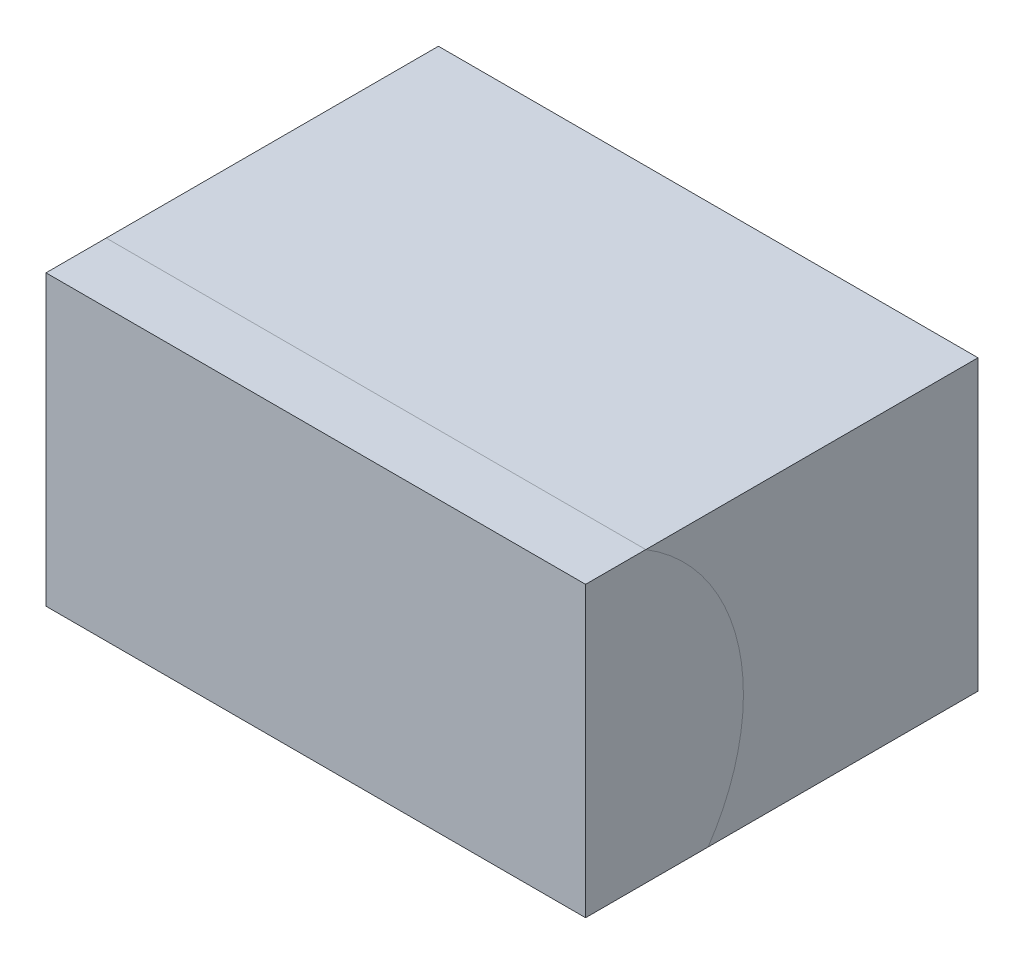
ISO-10303-21;
HEADER;
FILE_DESCRIPTION(('STEP AP214'),'2;1');
FILE_NAME('part.step','',(''),(''),'','','');
FILE_SCHEMA(('AUTOMOTIVE_DESIGN { 1 0 10303 214 1 1 1 1 }'));
ENDSEC;
DATA;
#1=APPLICATION_CONTEXT('core data for automotive mechanical design processes');
#2=APPLICATION_PROTOCOL_DEFINITION('international standard','automotive_design',2000,#1);
#3=PRODUCT_CONTEXT('',#1,'mechanical');
#4=PRODUCT('Part','Part','',(#3));
#5=PRODUCT_RELATED_PRODUCT_CATEGORY('part','',(#4));
#6=PRODUCT_DEFINITION_FORMATION('','',#4);
#7=PRODUCT_DEFINITION_CONTEXT('part definition',#1,'design');
#8=PRODUCT_DEFINITION('design','',#6,#7);
#9=PRODUCT_DEFINITION_SHAPE('','',#8);
#10=(LENGTH_UNIT() NAMED_UNIT(*) SI_UNIT(.MILLI.,.METRE.));
#11=(NAMED_UNIT(*) PLANE_ANGLE_UNIT() SI_UNIT($,.RADIAN.));
#12=(NAMED_UNIT(*) SI_UNIT($,.STERADIAN.) SOLID_ANGLE_UNIT());
#13=UNCERTAINTY_MEASURE_WITH_UNIT(LENGTH_MEASURE(1.E-05),#10,'distance_accuracy_value','');
#14=(GEOMETRIC_REPRESENTATION_CONTEXT(3) GLOBAL_UNCERTAINTY_ASSIGNED_CONTEXT((#13)) GLOBAL_UNIT_ASSIGNED_CONTEXT((#10,
#11,#12)) REPRESENTATION_CONTEXT('',''));
#15=CARTESIAN_POINT('',(0.,0.,0.));
#16=DIRECTION('',(0.,0.,1.));
#17=DIRECTION('',(1.,0.,0.));
#18=AXIS2_PLACEMENT_3D('',#15,#16,#17);
#19=CARTESIAN_POINT('',(-93.4295995241872,-10.287662998454,83.949911321681));
#20=DIRECTION('',(1.,0.,0.));
#21=DIRECTION('',(0.,0.,-1.));
#22=AXIS2_PLACEMENT_3D('',#19,#20,#21);
#23=CYLINDRICAL_SURFACE('',#22,70.6589672597011);
#24=CARTESIAN_POINT('',(93.4295995241872,-10.287662998454,83.949911321681));
#25=DIRECTION('',(-1.,0.,0.));
#26=DIRECTION('',(0.,0.,1.));
#27=AXIS2_PLACEMENT_3D('',#24,#25,#26);
#28=CIRCLE('',#27,70.6589672597011);
#29=CARTESIAN_POINT('',(93.4295995241872,-50.,25.5066059387446));
#30=VERTEX_POINT('',#29);
#31=CARTESIAN_POINT('',(93.4295995241872,50.,47.097674694953));
#32=VERTEX_POINT('',#31);
#33=EDGE_CURVE('E98',#30,#32,#28,.F.);
#34=ORIENTED_EDGE('',*,*,#33,.T.);
#35=DIRECTION('',(1.,0.,0.));
#36=VECTOR('',#35,1.);
#37=CARTESIAN_POINT('',(-93.4295995241872,50.,47.097674694953));
#38=LINE('',#37,#36);
#39=CARTESIAN_POINT('',(-93.4295995241872,50.,47.097674694953));
#40=VERTEX_POINT('',#39);
#41=EDGE_CURVE('E82',#40,#32,#38,.T.);
#42=ORIENTED_EDGE('',*,*,#41,.F.);
#43=CARTESIAN_POINT('',(-93.4295995241872,-10.287662998454,83.949911321681));
#44=DIRECTION('',(1.,0.,0.));
#45=DIRECTION('',(0.,0.,-1.));
#46=AXIS2_PLACEMENT_3D('',#43,#44,#45);
#47=CIRCLE('',#46,70.6589672597011);
#48=CARTESIAN_POINT('',(-93.4295995241872,-50.,25.5066059387446));
#49=VERTEX_POINT('',#48);
#50=EDGE_CURVE('E102',#40,#49,#47,.F.);
#51=ORIENTED_EDGE('',*,*,#50,.T.);
#52=DIRECTION('',(1.,0.,0.));
#53=VECTOR('',#52,1.);
#54=CARTESIAN_POINT('',(-93.4295995241872,-50.,25.5066059387446));
#55=LINE('',#54,#53);
#56=EDGE_CURVE('E95',#49,#30,#55,.T.);
#57=ORIENTED_EDGE('',*,*,#56,.T.);
#58=EDGE_LOOP('',(#34,#42,#51,#57));
#59=FACE_BOUND('',#58,.T.);
#60=ADVANCED_FACE('F50',(#59),#23,.F.);
#61=CARTESIAN_POINT('',(0.,50.,0.));
#62=DIRECTION('',(0.,1.,0.));
#63=DIRECTION('',(0.,0.,1.));
#64=AXIS2_PLACEMENT_3D('',#61,#62,#63);
#65=PLANE('',#64);
#66=DIRECTION('',(0.,0.,1.));
#67=VECTOR('',#66,1.);
#68=CARTESIAN_POINT('',(-93.4295995241872,50.,-67.9487996539543));
#69=LINE('',#68,#67);
#70=CARTESIAN_POINT('',(-93.4295995241872,50.,-67.9487996539543));
#71=VERTEX_POINT('',#70);
#72=EDGE_CURVE('E109',#71,#40,#69,.T.);
#73=ORIENTED_EDGE('',*,*,#72,.T.);
#74=ORIENTED_EDGE('',*,*,#41,.T.);
#75=DIRECTION('',(0.,0.,-1.));
#76=VECTOR('',#75,1.);
#77=CARTESIAN_POINT('',(93.4295995241872,50.,-67.9487996539543));
#78=LINE('',#77,#76);
#79=CARTESIAN_POINT('',(93.4295995241872,50.,-67.9487996539543));
#80=VERTEX_POINT('',#79);
#81=EDGE_CURVE('E100',#32,#80,#78,.T.);
#82=ORIENTED_EDGE('',*,*,#81,.T.);
#83=DIRECTION('',(-1.,0.,0.));
#84=VECTOR('',#83,1.);
#85=CARTESIAN_POINT('',(-93.4295995241872,50.,-67.9487996539543));
#86=LINE('',#85,#84);
#87=EDGE_CURVE('E77',#80,#71,#86,.T.);
#88=ORIENTED_EDGE('',*,*,#87,.T.);
#89=EDGE_LOOP('',(#73,#74,#82,#88));
#90=FACE_BOUND('',#89,.T.);
#91=ADVANCED_FACE('F52',(#90),#65,.T.);
#92=CARTESIAN_POINT('',(0.,-50.,0.));
#93=DIRECTION('',(0.,1.,0.));
#94=DIRECTION('',(0.,0.,1.));
#95=AXIS2_PLACEMENT_3D('',#92,#93,#94);
#96=PLANE('',#95);
#97=ORIENTED_EDGE('',*,*,#56,.F.);
#98=DIRECTION('',(0.,0.,1.));
#99=VECTOR('',#98,1.);
#100=CARTESIAN_POINT('',(-93.4295995241872,-50.,-67.9487996539543));
#101=LINE('',#100,#99);
#102=CARTESIAN_POINT('',(-93.4295995241872,-50.,-67.9487996539543));
#103=VERTEX_POINT('',#102);
#104=EDGE_CURVE('E112',#103,#49,#101,.T.);
#105=ORIENTED_EDGE('',*,*,#104,.F.);
#106=DIRECTION('',(-1.,0.,0.));
#107=VECTOR('',#106,1.);
#108=CARTESIAN_POINT('',(-93.4295995241872,-50.,-67.9487996539543));
#109=LINE('',#108,#107);
#110=CARTESIAN_POINT('',(93.4295995241872,-50.,-67.9487996539543));
#111=VERTEX_POINT('',#110);
#112=EDGE_CURVE('E59',#111,#103,#109,.T.);
#113=ORIENTED_EDGE('',*,*,#112,.F.);
#114=DIRECTION('',(0.,0.,-1.));
#115=VECTOR('',#114,1.);
#116=CARTESIAN_POINT('',(93.4295995241872,-50.,-67.9487996539543));
#117=LINE('',#116,#115);
#118=EDGE_CURVE('E12',#30,#111,#117,.T.);
#119=ORIENTED_EDGE('',*,*,#118,.F.);
#120=EDGE_LOOP('',(#97,#105,#113,#119));
#121=FACE_BOUND('',#120,.T.);
#122=ADVANCED_FACE('F92',(#121),#96,.F.);
#123=CARTESIAN_POINT('',(93.4295995241872,50.,-67.9487996539543));
#124=DIRECTION('',(-1.,0.,0.));
#125=DIRECTION('',(0.,0.,1.));
#126=AXIS2_PLACEMENT_3D('',#123,#124,#125);
#127=PLANE('',#126);
#128=ORIENTED_EDGE('',*,*,#33,.F.);
#129=ORIENTED_EDGE('',*,*,#118,.T.);
#130=DIRECTION('',(0.,-1.,0.));
#131=VECTOR('',#130,1.);
#132=CARTESIAN_POINT('',(93.4295995241872,50.,-67.9487996539543));
#133=LINE('',#132,#131);
#134=EDGE_CURVE('E122',#80,#111,#133,.T.);
#135=ORIENTED_EDGE('',*,*,#134,.F.);
#136=ORIENTED_EDGE('',*,*,#81,.F.);
#137=EDGE_LOOP('',(#128,#129,#135,#136));
#138=FACE_BOUND('',#137,.T.);
#139=ADVANCED_FACE('F99',(#138),#127,.F.);
#140=CARTESIAN_POINT('',(-93.4295995241872,50.,-67.9487996539543));
#141=DIRECTION('',(0.,0.,1.));
#142=DIRECTION('',(1.,0.,0.));
#143=AXIS2_PLACEMENT_3D('',#140,#141,#142);
#144=PLANE('',#143);
#145=ORIENTED_EDGE('',*,*,#112,.T.);
#146=DIRECTION('',(0.,-1.,0.));
#147=VECTOR('',#146,1.);
#148=CARTESIAN_POINT('',(-93.4295995241872,50.,-67.9487996539543));
#149=LINE('',#148,#147);
#150=EDGE_CURVE('E111',#71,#103,#149,.T.);
#151=ORIENTED_EDGE('',*,*,#150,.F.);
#152=ORIENTED_EDGE('',*,*,#87,.F.);
#153=ORIENTED_EDGE('',*,*,#134,.T.);
#154=EDGE_LOOP('',(#145,#151,#152,#153));
#155=FACE_BOUND('',#154,.T.);
#156=ADVANCED_FACE('F127',(#155),#144,.F.);
#157=CARTESIAN_POINT('',(-93.4295995241872,50.,-67.9487996539543));
#158=DIRECTION('',(1.,0.,0.));
#159=DIRECTION('',(0.,0.,-1.));
#160=AXIS2_PLACEMENT_3D('',#157,#158,#159);
#161=PLANE('',#160);
#162=ORIENTED_EDGE('',*,*,#50,.F.);
#163=ORIENTED_EDGE('',*,*,#72,.F.);
#164=ORIENTED_EDGE('',*,*,#150,.T.);
#165=ORIENTED_EDGE('',*,*,#104,.T.);
#166=EDGE_LOOP('',(#162,#163,#164,#165));
#167=FACE_BOUND('',#166,.T.);
#168=ADVANCED_FACE('F126',(#167),#161,.F.);
#169=CLOSED_SHELL('',(#60,#91,#122,#139,#156,#168));
#170=MANIFOLD_SOLID_BREP('B2',#169);
#171=CARTESIAN_POINT('',(-93.4295995241872,-10.287662998454,83.949911321681));
#172=DIRECTION('',(1.,0.,0.));
#173=DIRECTION('',(0.,0.,-1.));
#174=AXIS2_PLACEMENT_3D('',#171,#172,#173);
#175=CYLINDRICAL_SURFACE('',#174,70.6589672597011);
#176=CARTESIAN_POINT('',(93.4295995241872,-10.287662998454,83.949911321681));
#177=DIRECTION('',(-1.,0.,0.));
#178=DIRECTION('',(0.,0.,1.));
#179=AXIS2_PLACEMENT_3D('',#176,#177,#178);
#180=CIRCLE('',#179,70.6589672597011);
#181=CARTESIAN_POINT('',(93.4295995241872,-50.,25.5066059387446));
#182=VERTEX_POINT('',#181);
#183=CARTESIAN_POINT('',(93.4295995241872,50.,47.097674694953));
#184=VERTEX_POINT('',#183);
#185=EDGE_CURVE('E189',#182,#184,#180,.F.);
#186=ORIENTED_EDGE('',*,*,#185,.F.);
#187=DIRECTION('',(1.,0.,0.));
#188=VECTOR('',#187,1.);
#189=CARTESIAN_POINT('',(-93.4295995241872,-50.,25.5066059387446));
#190=LINE('',#189,#188);
#191=CARTESIAN_POINT('',(-93.4295995241872,-50.,25.5066059387446));
#192=VERTEX_POINT('',#191);
#193=EDGE_CURVE('E238',#192,#182,#190,.T.);
#194=ORIENTED_EDGE('',*,*,#193,.F.);
#195=CARTESIAN_POINT('',(-93.4295995241872,-10.287662998454,83.949911321681));
#196=DIRECTION('',(1.,0.,0.));
#197=DIRECTION('',(0.,0.,-1.));
#198=AXIS2_PLACEMENT_3D('',#195,#196,#197);
#199=CIRCLE('',#198,70.6589672597011);
#200=CARTESIAN_POINT('',(-93.4295995241872,50.,47.097674694953));
#201=VERTEX_POINT('',#200);
#202=EDGE_CURVE('E255',#201,#192,#199,.F.);
#203=ORIENTED_EDGE('',*,*,#202,.F.);
#204=DIRECTION('',(1.,0.,0.));
#205=VECTOR('',#204,1.);
#206=CARTESIAN_POINT('',(-93.4295995241872,50.,47.097674694953));
#207=LINE('',#206,#205);
#208=EDGE_CURVE('E48',#201,#184,#207,.T.);
#209=ORIENTED_EDGE('',*,*,#208,.T.);
#210=EDGE_LOOP('',(#186,#194,#203,#209));
#211=FACE_BOUND('',#210,.T.);
#212=ADVANCED_FACE('F186',(#211),#175,.T.);
#213=CARTESIAN_POINT('',(-93.4295995241872,50.,67.9487996539543));
#214=DIRECTION('',(0.,0.,-1.));
#215=DIRECTION('',(-1.,0.,0.));
#216=AXIS2_PLACEMENT_3D('',#213,#214,#215);
#217=PLANE('',#216);
#218=DIRECTION('',(1.,0.,0.));
#219=VECTOR('',#218,1.);
#220=CARTESIAN_POINT('',(-93.4295995241872,-50.,67.9487996539543));
#221=LINE('',#220,#219);
#222=CARTESIAN_POINT('',(-93.4295995241872,-50.,67.9487996539543));
#223=VERTEX_POINT('',#222);
#224=CARTESIAN_POINT('',(93.4295995241872,-50.,67.9487996539543));
#225=VERTEX_POINT('',#224);
#226=EDGE_CURVE('E252',#223,#225,#221,.T.);
#227=ORIENTED_EDGE('',*,*,#226,.T.);
#228=DIRECTION('',(0.,-1.,0.));
#229=VECTOR('',#228,1.);
#230=CARTESIAN_POINT('',(93.4295995241872,50.,67.9487996539543));
#231=LINE('',#230,#229);
#232=CARTESIAN_POINT('',(93.4295995241872,50.,67.9487996539543));
#233=VERTEX_POINT('',#232);
#234=EDGE_CURVE('E239',#233,#225,#231,.T.);
#235=ORIENTED_EDGE('',*,*,#234,.F.);
#236=DIRECTION('',(1.,0.,0.));
#237=VECTOR('',#236,1.);
#238=CARTESIAN_POINT('',(-93.4295995241872,50.,67.9487996539543));
#239=LINE('',#238,#237);
#240=CARTESIAN_POINT('',(-93.4295995241872,50.,67.9487996539543));
#241=VERTEX_POINT('',#240);
#242=EDGE_CURVE('E226',#241,#233,#239,.T.);
#243=ORIENTED_EDGE('',*,*,#242,.F.);
#244=DIRECTION('',(0.,-1.,0.));
#245=VECTOR('',#244,1.);
#246=CARTESIAN_POINT('',(-93.4295995241872,50.,67.9487996539543));
#247=LINE('',#246,#245);
#248=EDGE_CURVE('E232',#241,#223,#247,.T.);
#249=ORIENTED_EDGE('',*,*,#248,.T.);
#250=EDGE_LOOP('',(#227,#235,#243,#249));
#251=FACE_BOUND('',#250,.T.);
#252=ADVANCED_FACE('F241',(#251),#217,.F.);
#253=CARTESIAN_POINT('',(93.4295995241872,50.,-67.9487996539543));
#254=DIRECTION('',(-1.,0.,0.));
#255=DIRECTION('',(0.,0.,1.));
#256=AXIS2_PLACEMENT_3D('',#253,#254,#255);
#257=PLANE('',#256);
#258=DIRECTION('',(0.,0.,-1.));
#259=VECTOR('',#258,1.);
#260=CARTESIAN_POINT('',(93.4295995241872,-50.,-67.9487996539543));
#261=LINE('',#260,#259);
#262=EDGE_CURVE('E248',#225,#182,#261,.T.);
#263=ORIENTED_EDGE('',*,*,#262,.T.);
#264=ORIENTED_EDGE('',*,*,#185,.T.);
#265=DIRECTION('',(0.,0.,-1.));
#266=VECTOR('',#265,1.);
#267=CARTESIAN_POINT('',(93.4295995241872,50.,-67.9487996539543));
#268=LINE('',#267,#266);
#269=EDGE_CURVE('E229',#233,#184,#268,.T.);
#270=ORIENTED_EDGE('',*,*,#269,.F.);
#271=ORIENTED_EDGE('',*,*,#234,.T.);
#272=EDGE_LOOP('',(#263,#264,#270,#271));
#273=FACE_BOUND('',#272,.T.);
#274=ADVANCED_FACE('F264',(#273),#257,.F.);
#275=CARTESIAN_POINT('',(-93.4295995241872,50.,-67.9487996539543));
#276=DIRECTION('',(1.,0.,0.));
#277=DIRECTION('',(0.,0.,-1.));
#278=AXIS2_PLACEMENT_3D('',#275,#276,#277);
#279=PLANE('',#278);
#280=DIRECTION('',(0.,0.,1.));
#281=VECTOR('',#280,1.);
#282=CARTESIAN_POINT('',(-93.4295995241872,50.,-67.9487996539543));
#283=LINE('',#282,#281);
#284=EDGE_CURVE('E222',#201,#241,#283,.T.);
#285=ORIENTED_EDGE('',*,*,#284,.F.);
#286=ORIENTED_EDGE('',*,*,#202,.T.);
#287=DIRECTION('',(0.,0.,1.));
#288=VECTOR('',#287,1.);
#289=CARTESIAN_POINT('',(-93.4295995241872,-50.,-67.9487996539543));
#290=LINE('',#289,#288);
#291=EDGE_CURVE('E235',#192,#223,#290,.T.);
#292=ORIENTED_EDGE('',*,*,#291,.T.);
#293=ORIENTED_EDGE('',*,*,#248,.F.);
#294=EDGE_LOOP('',(#285,#286,#292,#293));
#295=FACE_BOUND('',#294,.T.);
#296=ADVANCED_FACE('F233',(#295),#279,.F.);
#297=CARTESIAN_POINT('',(0.,-50.,0.));
#298=DIRECTION('',(0.,1.,0.));
#299=DIRECTION('',(0.,0.,1.));
#300=AXIS2_PLACEMENT_3D('',#297,#298,#299);
#301=PLANE('',#300);
#302=ORIENTED_EDGE('',*,*,#291,.F.);
#303=ORIENTED_EDGE('',*,*,#193,.T.);
#304=ORIENTED_EDGE('',*,*,#262,.F.);
#305=ORIENTED_EDGE('',*,*,#226,.F.);
#306=EDGE_LOOP('',(#302,#303,#304,#305));
#307=FACE_BOUND('',#306,.T.);
#308=ADVANCED_FACE('F267',(#307),#301,.F.);
#309=CARTESIAN_POINT('',(0.,50.,0.));
#310=DIRECTION('',(0.,1.,0.));
#311=DIRECTION('',(0.,0.,1.));
#312=AXIS2_PLACEMENT_3D('',#309,#310,#311);
#313=PLANE('',#312);
#314=ORIENTED_EDGE('',*,*,#208,.F.);
#315=ORIENTED_EDGE('',*,*,#284,.T.);
#316=ORIENTED_EDGE('',*,*,#242,.T.);
#317=ORIENTED_EDGE('',*,*,#269,.T.);
#318=EDGE_LOOP('',(#314,#315,#316,#317));
#319=FACE_BOUND('',#318,.T.);
#320=ADVANCED_FACE('F224',(#319),#313,.T.);
#321=CLOSED_SHELL('',(#212,#252,#274,#296,#308,#320));
#322=MANIFOLD_SOLID_BREP('B6',#321);
#323=CARTESIAN_POINT('',(-93.4295995241872,-10.287662998454,83.949911321681));
#324=DIRECTION('',(1.,0.,0.));
#325=DIRECTION('',(0.,0.,-1.));
#326=AXIS2_PLACEMENT_3D('',#323,#324,#325);
#327=CYLINDRICAL_SURFACE('',#326,70.6589672597011);
#328=CARTESIAN_POINT('',(93.4295995241872,-10.287662998454,83.949911321681));
#329=DIRECTION('',(-1.,0.,0.));
#330=DIRECTION('',(0.,0.,1.));
#331=AXIS2_PLACEMENT_3D('',#328,#329,#330);
#332=CIRCLE('',#331,70.6589672597011);
#333=CARTESIAN_POINT('',(93.4295995241872,50.0000000000001,47.0976746949531));
#334=VERTEX_POINT('',#333);
#335=CARTESIAN_POINT('',(93.4295995241872,-49.9999999999999,25.5066059387446));
#336=VERTEX_POINT('',#335);
#337=EDGE_CURVE('E338',#334,#336,#332,.T.);
#338=ORIENTED_EDGE('',*,*,#337,.F.);
#339=DIRECTION('',(1.,0.,0.));
#340=VECTOR('',#339,1.);
#341=CARTESIAN_POINT('',(-93.4295995241872,50.0000000000001,47.0976746949531));
#342=LINE('',#341,#340);
#343=CARTESIAN_POINT('',(-93.4295995241872,50.0000000000001,47.0976746949531));
#344=VERTEX_POINT('',#343);
#345=EDGE_CURVE('E320',#344,#334,#342,.T.);
#346=ORIENTED_EDGE('',*,*,#345,.F.);
#347=CARTESIAN_POINT('',(-93.4295995241872,-10.287662998454,83.949911321681));
#348=DIRECTION('',(-1.,0.,0.));
#349=DIRECTION('',(0.,0.,1.));
#350=AXIS2_PLACEMENT_3D('',#347,#348,#349);
#351=CIRCLE('',#350,70.6589672597011);
#352=CARTESIAN_POINT('',(-93.4295995241872,-49.9999999999999,25.5066059387446));
#353=VERTEX_POINT('',#352);
#354=EDGE_CURVE('E326',#344,#353,#351,.T.);
#355=ORIENTED_EDGE('',*,*,#354,.T.);
#356=DIRECTION('',(1.,0.,0.));
#357=VECTOR('',#356,1.);
#358=CARTESIAN_POINT('',(-93.4295995241872,-49.9999999999999,25.5066059387446));
#359=LINE('',#358,#357);
#360=EDGE_CURVE('E184',#353,#336,#359,.T.);
#361=ORIENTED_EDGE('',*,*,#360,.T.);
#362=EDGE_LOOP('',(#338,#346,#355,#361));
#363=FACE_BOUND('',#362,.T.);
#364=ADVANCED_FACE('F319',(#363),#327,.F.);
#365=OPEN_SHELL('',(#364));
#366=SHELL_BASED_SURFACE_MODEL('B42',(#365));
#367=ADVANCED_BREP_SHAPE_REPRESENTATION('',(#18,#170,#322),#14);
#368=MANIFOLD_SURFACE_SHAPE_REPRESENTATION('',(#18,#366),#14);
#369=SHAPE_REPRESENTATION('',(#18),#14);
#370=SHAPE_DEFINITION_REPRESENTATION(#9,#369);
#371=SHAPE_REPRESENTATION_RELATIONSHIP('','',#369,#367);
#372=SHAPE_REPRESENTATION_RELATIONSHIP('','',#369,#368);
ENDSEC;
END-ISO-10303-21;
